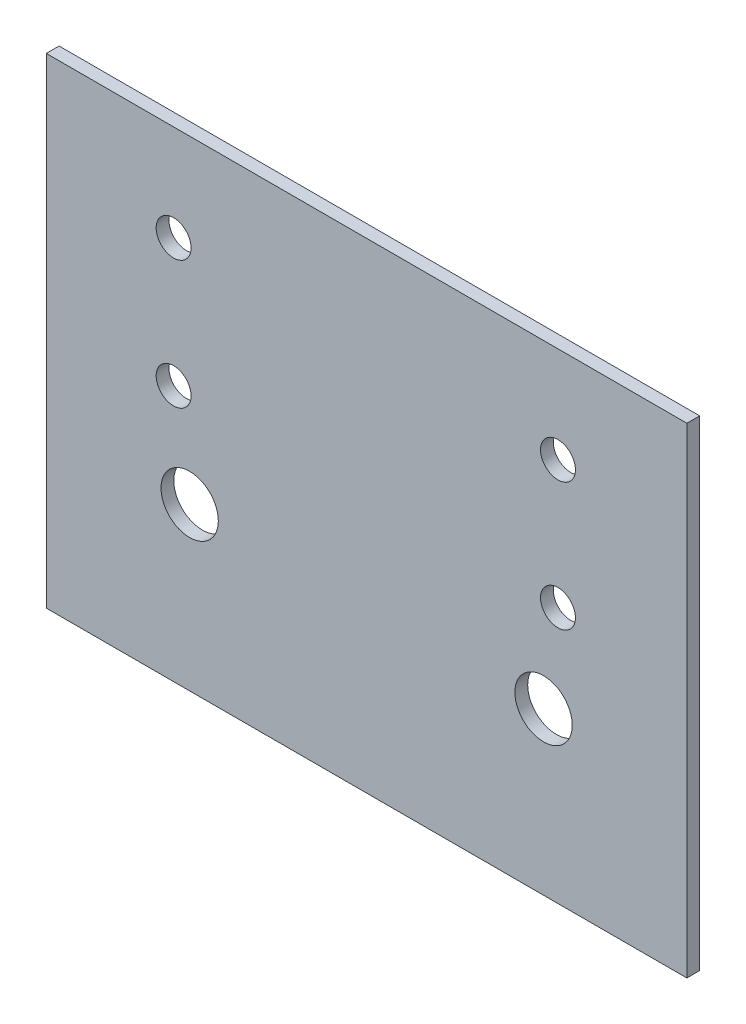
ISO-10303-21;
HEADER;
FILE_DESCRIPTION(('STEP AP214'),'2;1');
FILE_NAME('part.step','',(''),(''),'','','');
FILE_SCHEMA(('AUTOMOTIVE_DESIGN { 1 0 10303 214 1 1 1 1 }'));
ENDSEC;
DATA;
#1=APPLICATION_CONTEXT('core data for automotive mechanical design processes');
#2=APPLICATION_PROTOCOL_DEFINITION('international standard','automotive_design',2000,#1);
#3=PRODUCT_CONTEXT('',#1,'mechanical');
#4=PRODUCT('Part','Part','',(#3));
#5=PRODUCT_RELATED_PRODUCT_CATEGORY('part','',(#4));
#6=PRODUCT_DEFINITION_FORMATION('','',#4);
#7=PRODUCT_DEFINITION_CONTEXT('part definition',#1,'design');
#8=PRODUCT_DEFINITION('design','',#6,#7);
#9=PRODUCT_DEFINITION_SHAPE('','',#8);
#10=(LENGTH_UNIT() NAMED_UNIT(*) SI_UNIT(.MILLI.,.METRE.));
#11=(NAMED_UNIT(*) PLANE_ANGLE_UNIT() SI_UNIT($,.RADIAN.));
#12=(NAMED_UNIT(*) SI_UNIT($,.STERADIAN.) SOLID_ANGLE_UNIT());
#13=UNCERTAINTY_MEASURE_WITH_UNIT(LENGTH_MEASURE(1.E-05),#10,'distance_accuracy_value','');
#14=(GEOMETRIC_REPRESENTATION_CONTEXT(3) GLOBAL_UNCERTAINTY_ASSIGNED_CONTEXT((#13)) GLOBAL_UNIT_ASSIGNED_CONTEXT((#10,
#11,#12)) REPRESENTATION_CONTEXT('',''));
#15=CARTESIAN_POINT('',(0.,0.,0.));
#16=DIRECTION('',(0.,0.,1.));
#17=DIRECTION('',(1.,0.,0.));
#18=AXIS2_PLACEMENT_3D('',#15,#16,#17);
#19=CARTESIAN_POINT('',(0.,0.,8.));
#20=DIRECTION('',(0.,0.,1.));
#21=DIRECTION('',(1.,0.,0.));
#22=AXIS2_PLACEMENT_3D('',#19,#20,#21);
#23=PLANE('',#22);
#24=CARTESIAN_POINT('',(255.389912032617,-164.958171337054,8.));
#25=DIRECTION('',(0.,0.,1.));
#26=DIRECTION('',(-1.,0.,0.));
#27=AXIS2_PLACEMENT_3D('',#24,#25,#26);
#28=CIRCLE('',#27,17.9);
#29=CARTESIAN_POINT('',(237.489912032617,-164.958171337054,8.));
#30=VERTEX_POINT('',#29);
#31=EDGE_CURVE('E135',#30,#30,#28,.T.);
#32=ORIENTED_EDGE('',*,*,#31,.F.);
#33=EDGE_LOOP('',(#32));
#34=FACE_BOUND('',#33,.T.);
#35=CARTESIAN_POINT('',(264.3978692291,-25.7973735060581,8.));
#36=DIRECTION('',(0.,0.,1.));
#37=DIRECTION('',(-1.,0.,0.));
#38=AXIS2_PLACEMENT_3D('',#35,#36,#37);
#39=CIRCLE('',#38,10.9);
#40=CARTESIAN_POINT('',(253.4978692291,-25.7973735060581,8.));
#41=VERTEX_POINT('',#40);
#42=EDGE_CURVE('E123',#41,#41,#39,.T.);
#43=ORIENTED_EDGE('',*,*,#42,.F.);
#44=EDGE_LOOP('',(#43));
#45=FACE_BOUND('',#44,.T.);
#46=CARTESIAN_POINT('',(24.3978692290998,-105.797373506058,8.));
#47=DIRECTION('',(0.,0.,1.));
#48=DIRECTION('',(1.,0.,0.));
#49=AXIS2_PLACEMENT_3D('',#46,#47,#48);
#50=CIRCLE('',#49,10.9);
#51=CARTESIAN_POINT('',(35.2978692290998,-105.797373506058,8.));
#52=VERTEX_POINT('',#51);
#53=EDGE_CURVE('E102',#52,#52,#50,.T.);
#54=ORIENTED_EDGE('',*,*,#53,.F.);
#55=EDGE_LOOP('',(#54));
#56=FACE_BOUND('',#55,.T.);
#57=DIRECTION('',(0.,-1.,0.));
#58=VECTOR('',#57,1.);
#59=CARTESIAN_POINT('',(-55.1061093691418,34.2026264939419,8.));
#60=LINE('',#59,#58);
#61=CARTESIAN_POINT('',(-55.1061093691418,34.2026264939419,8.));
#62=VERTEX_POINT('',#61);
#63=CARTESIAN_POINT('',(-55.1061093691418,-265.797373506058,8.));
#64=VERTEX_POINT('',#63);
#65=EDGE_CURVE('E87',#62,#64,#60,.T.);
#66=ORIENTED_EDGE('',*,*,#65,.T.);
#67=DIRECTION('',(1.,0.,0.));
#68=VECTOR('',#67,1.);
#69=CARTESIAN_POINT('',(-55.1061093691418,-265.797373506058,8.));
#70=LINE('',#69,#68);
#71=CARTESIAN_POINT('',(344.893890630858,-265.797373506058,8.));
#72=VERTEX_POINT('',#71);
#73=EDGE_CURVE('E82',#64,#72,#70,.T.);
#74=ORIENTED_EDGE('',*,*,#73,.T.);
#75=DIRECTION('',(0.,1.,0.));
#76=VECTOR('',#75,1.);
#77=CARTESIAN_POINT('',(344.893890630858,-265.797373506058,8.));
#78=LINE('',#77,#76);
#79=CARTESIAN_POINT('',(344.893890630858,34.2026264939419,8.));
#80=VERTEX_POINT('',#79);
#81=EDGE_CURVE('E85',#72,#80,#78,.T.);
#82=ORIENTED_EDGE('',*,*,#81,.T.);
#83=DIRECTION('',(-1.,0.,0.));
#84=VECTOR('',#83,1.);
#85=CARTESIAN_POINT('',(-55.1061093691418,34.2026264939419,8.));
#86=LINE('',#85,#84);
#87=EDGE_CURVE('E52',#80,#62,#86,.T.);
#88=ORIENTED_EDGE('',*,*,#87,.T.);
#89=EDGE_LOOP('',(#66,#74,#82,#88));
#90=FACE_BOUND('',#89,.T.);
#91=CARTESIAN_POINT('',(24.3978692290998,-25.7973735060581,8.));
#92=DIRECTION('',(0.,0.,1.));
#93=DIRECTION('',(1.,0.,0.));
#94=AXIS2_PLACEMENT_3D('',#91,#92,#93);
#95=CIRCLE('',#94,10.9);
#96=CARTESIAN_POINT('',(35.2978692290998,-25.7973735060581,8.));
#97=VERTEX_POINT('',#96);
#98=EDGE_CURVE('E117',#97,#97,#95,.T.);
#99=ORIENTED_EDGE('',*,*,#98,.F.);
#100=EDGE_LOOP('',(#99));
#101=FACE_BOUND('',#100,.T.);
#102=CARTESIAN_POINT('',(264.3978692291,-105.797373506058,8.));
#103=DIRECTION('',(0.,0.,1.));
#104=DIRECTION('',(1.,0.,0.));
#105=AXIS2_PLACEMENT_3D('',#102,#103,#104);
#106=CIRCLE('',#105,10.9);
#107=CARTESIAN_POINT('',(275.2978692291,-105.797373506058,8.));
#108=VERTEX_POINT('',#107);
#109=EDGE_CURVE('E129',#108,#108,#106,.T.);
#110=ORIENTED_EDGE('',*,*,#109,.F.);
#111=EDGE_LOOP('',(#110));
#112=FACE_BOUND('',#111,.T.);
#113=CARTESIAN_POINT('',(34.3978692290998,-164.958171337054,8.));
#114=DIRECTION('',(0.,0.,1.));
#115=DIRECTION('',(1.,0.,0.));
#116=AXIS2_PLACEMENT_3D('',#113,#114,#115);
#117=CIRCLE('',#116,17.9);
#118=CARTESIAN_POINT('',(52.2978692290998,-164.958171337054,8.));
#119=VERTEX_POINT('',#118);
#120=EDGE_CURVE('E141',#119,#119,#117,.T.);
#121=ORIENTED_EDGE('',*,*,#120,.F.);
#122=EDGE_LOOP('',(#121));
#123=FACE_BOUND('',#122,.T.);
#124=ADVANCED_FACE('F35',(#34,#45,#56,#90,#101,#112,#123),#23,.T.);
#125=CARTESIAN_POINT('',(0.,0.,0.));
#126=DIRECTION('',(0.,0.,1.));
#127=DIRECTION('',(1.,0.,0.));
#128=AXIS2_PLACEMENT_3D('',#125,#126,#127);
#129=PLANE('',#128);
#130=DIRECTION('',(0.,-1.,0.));
#131=VECTOR('',#130,1.);
#132=CARTESIAN_POINT('',(-55.1061093691418,34.2026264939419,0.));
#133=LINE('',#132,#131);
#134=CARTESIAN_POINT('',(-55.1061093691418,34.2026264939419,0.));
#135=VERTEX_POINT('',#134);
#136=CARTESIAN_POINT('',(-55.1061093691418,-265.797373506058,0.));
#137=VERTEX_POINT('',#136);
#138=EDGE_CURVE('E99',#135,#137,#133,.T.);
#139=ORIENTED_EDGE('',*,*,#138,.F.);
#140=DIRECTION('',(-1.,0.,0.));
#141=VECTOR('',#140,1.);
#142=CARTESIAN_POINT('',(-55.1061093691418,34.2026264939419,0.));
#143=LINE('',#142,#141);
#144=CARTESIAN_POINT('',(344.893890630858,34.2026264939419,0.));
#145=VERTEX_POINT('',#144);
#146=EDGE_CURVE('E75',#145,#135,#143,.T.);
#147=ORIENTED_EDGE('',*,*,#146,.F.);
#148=DIRECTION('',(0.,1.,0.));
#149=VECTOR('',#148,1.);
#150=CARTESIAN_POINT('',(344.893890630858,-265.797373506058,0.));
#151=LINE('',#150,#149);
#152=CARTESIAN_POINT('',(344.893890630858,-265.797373506058,0.));
#153=VERTEX_POINT('',#152);
#154=EDGE_CURVE('E69',#153,#145,#151,.T.);
#155=ORIENTED_EDGE('',*,*,#154,.F.);
#156=DIRECTION('',(1.,0.,0.));
#157=VECTOR('',#156,1.);
#158=CARTESIAN_POINT('',(-55.1061093691418,-265.797373506058,0.));
#159=LINE('',#158,#157);
#160=EDGE_CURVE('E91',#137,#153,#159,.T.);
#161=ORIENTED_EDGE('',*,*,#160,.F.);
#162=EDGE_LOOP('',(#139,#147,#155,#161));
#163=FACE_BOUND('',#162,.T.);
#164=CARTESIAN_POINT('',(24.3978692290998,-105.797373506058,0.));
#165=DIRECTION('',(0.,0.,1.));
#166=DIRECTION('',(1.,0.,0.));
#167=AXIS2_PLACEMENT_3D('',#164,#165,#166);
#168=CIRCLE('',#167,10.9);
#169=CARTESIAN_POINT('',(35.2978692290998,-105.797373506058,0.));
#170=VERTEX_POINT('',#169);
#171=EDGE_CURVE('E114',#170,#170,#168,.T.);
#172=ORIENTED_EDGE('',*,*,#171,.T.);
#173=EDGE_LOOP('',(#172));
#174=FACE_BOUND('',#173,.T.);
#175=CARTESIAN_POINT('',(24.3978692290998,-25.7973735060581,0.));
#176=DIRECTION('',(0.,0.,1.));
#177=DIRECTION('',(1.,0.,0.));
#178=AXIS2_PLACEMENT_3D('',#175,#176,#177);
#179=CIRCLE('',#178,10.9);
#180=CARTESIAN_POINT('',(35.2978692290998,-25.7973735060581,0.));
#181=VERTEX_POINT('',#180);
#182=EDGE_CURVE('E120',#181,#181,#179,.T.);
#183=ORIENTED_EDGE('',*,*,#182,.T.);
#184=EDGE_LOOP('',(#183));
#185=FACE_BOUND('',#184,.T.);
#186=CARTESIAN_POINT('',(264.3978692291,-25.7973735060581,0.));
#187=DIRECTION('',(0.,0.,1.));
#188=DIRECTION('',(-1.,0.,0.));
#189=AXIS2_PLACEMENT_3D('',#186,#187,#188);
#190=CIRCLE('',#189,10.9);
#191=CARTESIAN_POINT('',(253.4978692291,-25.7973735060581,0.));
#192=VERTEX_POINT('',#191);
#193=EDGE_CURVE('E126',#192,#192,#190,.T.);
#194=ORIENTED_EDGE('',*,*,#193,.T.);
#195=EDGE_LOOP('',(#194));
#196=FACE_BOUND('',#195,.T.);
#197=CARTESIAN_POINT('',(264.3978692291,-105.797373506058,0.));
#198=DIRECTION('',(0.,0.,1.));
#199=DIRECTION('',(1.,0.,0.));
#200=AXIS2_PLACEMENT_3D('',#197,#198,#199);
#201=CIRCLE('',#200,10.9);
#202=CARTESIAN_POINT('',(275.2978692291,-105.797373506058,0.));
#203=VERTEX_POINT('',#202);
#204=EDGE_CURVE('E132',#203,#203,#201,.T.);
#205=ORIENTED_EDGE('',*,*,#204,.T.);
#206=EDGE_LOOP('',(#205));
#207=FACE_BOUND('',#206,.T.);
#208=CARTESIAN_POINT('',(255.389912032617,-164.958171337054,0.));
#209=DIRECTION('',(0.,0.,1.));
#210=DIRECTION('',(-1.,0.,0.));
#211=AXIS2_PLACEMENT_3D('',#208,#209,#210);
#212=CIRCLE('',#211,17.9);
#213=CARTESIAN_POINT('',(237.489912032617,-164.958171337054,0.));
#214=VERTEX_POINT('',#213);
#215=EDGE_CURVE('E138',#214,#214,#212,.T.);
#216=ORIENTED_EDGE('',*,*,#215,.T.);
#217=EDGE_LOOP('',(#216));
#218=FACE_BOUND('',#217,.T.);
#219=CARTESIAN_POINT('',(34.3978692290998,-164.958171337054,0.));
#220=DIRECTION('',(0.,0.,1.));
#221=DIRECTION('',(1.,0.,0.));
#222=AXIS2_PLACEMENT_3D('',#219,#220,#221);
#223=CIRCLE('',#222,17.9);
#224=CARTESIAN_POINT('',(52.2978692290998,-164.958171337054,0.));
#225=VERTEX_POINT('',#224);
#226=EDGE_CURVE('E144',#225,#225,#223,.T.);
#227=ORIENTED_EDGE('',*,*,#226,.T.);
#228=EDGE_LOOP('',(#227));
#229=FACE_BOUND('',#228,.T.);
#230=ADVANCED_FACE('F110',(#163,#174,#185,#196,#207,#218,#229),#129,.F.);
#231=CARTESIAN_POINT('',(-55.1061093691418,34.2026264939419,8.));
#232=DIRECTION('',(1.,0.,0.));
#233=DIRECTION('',(0.,1.,0.));
#234=AXIS2_PLACEMENT_3D('',#231,#232,#233);
#235=PLANE('',#234);
#236=ORIENTED_EDGE('',*,*,#138,.T.);
#237=DIRECTION('',(0.,0.,-1.));
#238=VECTOR('',#237,1.);
#239=CARTESIAN_POINT('',(-55.1061093691418,-265.797373506058,8.));
#240=LINE('',#239,#238);
#241=EDGE_CURVE('E11',#64,#137,#240,.T.);
#242=ORIENTED_EDGE('',*,*,#241,.F.);
#243=ORIENTED_EDGE('',*,*,#65,.F.);
#244=DIRECTION('',(0.,0.,-1.));
#245=VECTOR('',#244,1.);
#246=CARTESIAN_POINT('',(-55.1061093691418,34.2026264939419,8.));
#247=LINE('',#246,#245);
#248=EDGE_CURVE('E95',#62,#135,#247,.T.);
#249=ORIENTED_EDGE('',*,*,#248,.T.);
#250=EDGE_LOOP('',(#236,#242,#243,#249));
#251=FACE_BOUND('',#250,.T.);
#252=ADVANCED_FACE('F37',(#251),#235,.F.);
#253=CARTESIAN_POINT('',(-55.1061093691418,-265.797373506058,8.));
#254=DIRECTION('',(0.,1.,0.));
#255=DIRECTION('',(0.,0.,1.));
#256=AXIS2_PLACEMENT_3D('',#253,#254,#255);
#257=PLANE('',#256);
#258=ORIENTED_EDGE('',*,*,#160,.T.);
#259=DIRECTION('',(0.,0.,-1.));
#260=VECTOR('',#259,1.);
#261=CARTESIAN_POINT('',(344.893890630858,-265.797373506058,8.));
#262=LINE('',#261,#260);
#263=EDGE_CURVE('E44',#72,#153,#262,.T.);
#264=ORIENTED_EDGE('',*,*,#263,.F.);
#265=ORIENTED_EDGE('',*,*,#73,.F.);
#266=ORIENTED_EDGE('',*,*,#241,.T.);
#267=EDGE_LOOP('',(#258,#264,#265,#266));
#268=FACE_BOUND('',#267,.T.);
#269=ADVANCED_FACE('F90',(#268),#257,.F.);
#270=CARTESIAN_POINT('',(344.893890630858,-265.797373506058,8.));
#271=DIRECTION('',(-1.,0.,0.));
#272=DIRECTION('',(0.,0.,1.));
#273=AXIS2_PLACEMENT_3D('',#270,#271,#272);
#274=PLANE('',#273);
#275=ORIENTED_EDGE('',*,*,#154,.T.);
#276=DIRECTION('',(0.,0.,-1.));
#277=VECTOR('',#276,1.);
#278=CARTESIAN_POINT('',(344.893890630858,34.2026264939419,8.));
#279=LINE('',#278,#277);
#280=EDGE_CURVE('E92',#80,#145,#279,.T.);
#281=ORIENTED_EDGE('',*,*,#280,.F.);
#282=ORIENTED_EDGE('',*,*,#81,.F.);
#283=ORIENTED_EDGE('',*,*,#263,.T.);
#284=EDGE_LOOP('',(#275,#281,#282,#283));
#285=FACE_BOUND('',#284,.T.);
#286=ADVANCED_FACE('F93',(#285),#274,.F.);
#287=CARTESIAN_POINT('',(-55.1061093691418,34.2026264939419,8.));
#288=DIRECTION('',(0.,-1.,0.));
#289=DIRECTION('',(0.,0.,-1.));
#290=AXIS2_PLACEMENT_3D('',#287,#288,#289);
#291=PLANE('',#290);
#292=ORIENTED_EDGE('',*,*,#146,.T.);
#293=ORIENTED_EDGE('',*,*,#248,.F.);
#294=ORIENTED_EDGE('',*,*,#87,.F.);
#295=ORIENTED_EDGE('',*,*,#280,.T.);
#296=EDGE_LOOP('',(#292,#293,#294,#295));
#297=FACE_BOUND('',#296,.T.);
#298=ADVANCED_FACE('F107',(#297),#291,.F.);
#299=CARTESIAN_POINT('',(24.3978692290998,-105.797373506058,8.));
#300=DIRECTION('',(0.,0.,-1.));
#301=DIRECTION('',(-1.,0.,0.));
#302=AXIS2_PLACEMENT_3D('',#299,#300,#301);
#303=CYLINDRICAL_SURFACE('',#302,10.9);
#304=ORIENTED_EDGE('',*,*,#53,.T.);
#305=EDGE_LOOP('',(#304));
#306=FACE_BOUND('',#305,.T.);
#307=ORIENTED_EDGE('',*,*,#171,.F.);
#308=EDGE_LOOP('',(#307));
#309=FACE_BOUND('',#308,.T.);
#310=ADVANCED_FACE('F163',(#306,#309),#303,.F.);
#311=CARTESIAN_POINT('',(24.3978692290998,-25.7973735060581,8.));
#312=DIRECTION('',(0.,0.,-1.));
#313=DIRECTION('',(-1.,0.,0.));
#314=AXIS2_PLACEMENT_3D('',#311,#312,#313);
#315=CYLINDRICAL_SURFACE('',#314,10.9);
#316=ORIENTED_EDGE('',*,*,#98,.T.);
#317=EDGE_LOOP('',(#316));
#318=FACE_BOUND('',#317,.T.);
#319=ORIENTED_EDGE('',*,*,#182,.F.);
#320=EDGE_LOOP('',(#319));
#321=FACE_BOUND('',#320,.T.);
#322=ADVANCED_FACE('F209',(#318,#321),#315,.F.);
#323=CARTESIAN_POINT('',(264.3978692291,-25.7973735060581,8.));
#324=DIRECTION('',(0.,0.,-1.));
#325=DIRECTION('',(-1.,0.,0.));
#326=AXIS2_PLACEMENT_3D('',#323,#324,#325);
#327=CYLINDRICAL_SURFACE('',#326,10.9);
#328=ORIENTED_EDGE('',*,*,#42,.T.);
#329=EDGE_LOOP('',(#328));
#330=FACE_BOUND('',#329,.T.);
#331=ORIENTED_EDGE('',*,*,#193,.F.);
#332=EDGE_LOOP('',(#331));
#333=FACE_BOUND('',#332,.T.);
#334=ADVANCED_FACE('F217',(#330,#333),#327,.F.);
#335=CARTESIAN_POINT('',(264.3978692291,-105.797373506058,8.));
#336=DIRECTION('',(0.,0.,-1.));
#337=DIRECTION('',(-1.,0.,0.));
#338=AXIS2_PLACEMENT_3D('',#335,#336,#337);
#339=CYLINDRICAL_SURFACE('',#338,10.9);
#340=ORIENTED_EDGE('',*,*,#109,.T.);
#341=EDGE_LOOP('',(#340));
#342=FACE_BOUND('',#341,.T.);
#343=ORIENTED_EDGE('',*,*,#204,.F.);
#344=EDGE_LOOP('',(#343));
#345=FACE_BOUND('',#344,.T.);
#346=ADVANCED_FACE('F225',(#342,#345),#339,.F.);
#347=CARTESIAN_POINT('',(255.389912032617,-164.958171337054,8.));
#348=DIRECTION('',(0.,0.,-1.));
#349=DIRECTION('',(-1.,0.,0.));
#350=AXIS2_PLACEMENT_3D('',#347,#348,#349);
#351=CYLINDRICAL_SURFACE('',#350,17.9);
#352=ORIENTED_EDGE('',*,*,#31,.T.);
#353=EDGE_LOOP('',(#352));
#354=FACE_BOUND('',#353,.T.);
#355=ORIENTED_EDGE('',*,*,#215,.F.);
#356=EDGE_LOOP('',(#355));
#357=FACE_BOUND('',#356,.T.);
#358=ADVANCED_FACE('F234',(#354,#357),#351,.F.);
#359=CARTESIAN_POINT('',(34.3978692290998,-164.958171337054,8.));
#360=DIRECTION('',(0.,0.,-1.));
#361=DIRECTION('',(-1.,0.,0.));
#362=AXIS2_PLACEMENT_3D('',#359,#360,#361);
#363=CYLINDRICAL_SURFACE('',#362,17.9);
#364=ORIENTED_EDGE('',*,*,#120,.T.);
#365=EDGE_LOOP('',(#364));
#366=FACE_BOUND('',#365,.T.);
#367=ORIENTED_EDGE('',*,*,#226,.F.);
#368=EDGE_LOOP('',(#367));
#369=FACE_BOUND('',#368,.T.);
#370=ADVANCED_FACE('F150',(#366,#369),#363,.F.);
#371=CLOSED_SHELL('',(#124,#230,#252,#269,#286,#298,#310,#322,#334,#346,#358,#370));
#372=MANIFOLD_SOLID_BREP('B2',#371);
#373=ADVANCED_BREP_SHAPE_REPRESENTATION('',(#18,#372),#14);
#374=SHAPE_DEFINITION_REPRESENTATION(#9,#373);
ENDSEC;
END-ISO-10303-21;
